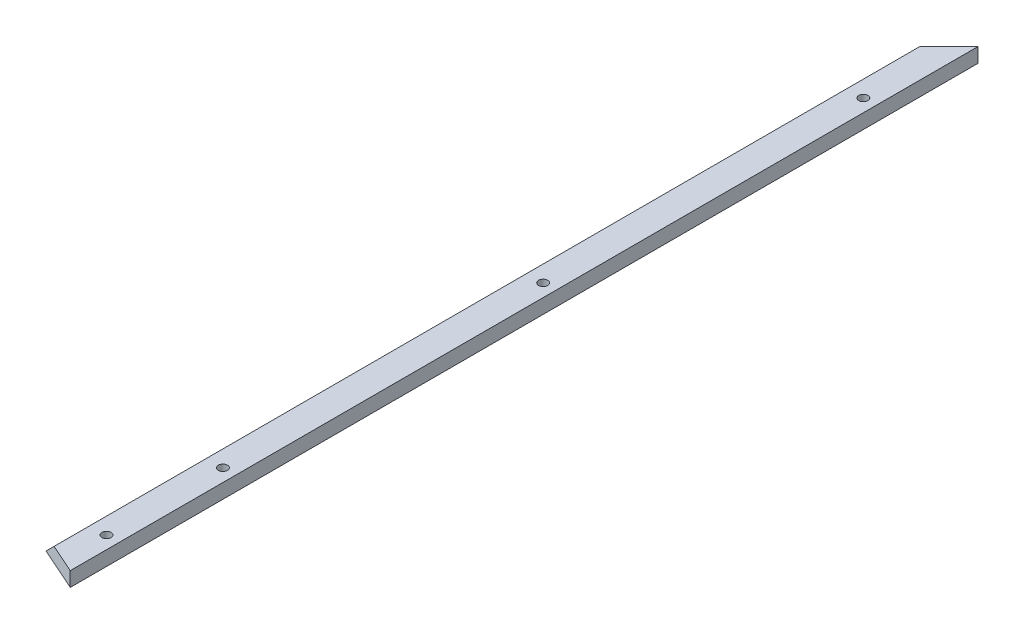
ISO-10303-21;
HEADER;
FILE_DESCRIPTION(('STEP AP214'),'2;1');
FILE_NAME('part.step','',(''),(''),'','','');
FILE_SCHEMA(('AUTOMOTIVE_DESIGN { 1 0 10303 214 1 1 1 1 }'));
ENDSEC;
DATA;
#1=APPLICATION_CONTEXT('core data for automotive mechanical design processes');
#2=APPLICATION_PROTOCOL_DEFINITION('international standard','automotive_design',2000,#1);
#3=PRODUCT_CONTEXT('',#1,'mechanical');
#4=PRODUCT('Part','Part','',(#3));
#5=PRODUCT_RELATED_PRODUCT_CATEGORY('part','',(#4));
#6=PRODUCT_DEFINITION_FORMATION('','',#4);
#7=PRODUCT_DEFINITION_CONTEXT('part definition',#1,'design');
#8=PRODUCT_DEFINITION('design','',#6,#7);
#9=PRODUCT_DEFINITION_SHAPE('','',#8);
#10=(LENGTH_UNIT() NAMED_UNIT(*) SI_UNIT(.MILLI.,.METRE.));
#11=(NAMED_UNIT(*) PLANE_ANGLE_UNIT() SI_UNIT($,.RADIAN.));
#12=(NAMED_UNIT(*) SI_UNIT($,.STERADIAN.) SOLID_ANGLE_UNIT());
#13=UNCERTAINTY_MEASURE_WITH_UNIT(LENGTH_MEASURE(1.E-05),#10,'distance_accuracy_value','');
#14=(GEOMETRIC_REPRESENTATION_CONTEXT(3) GLOBAL_UNCERTAINTY_ASSIGNED_CONTEXT((#13)) GLOBAL_UNIT_ASSIGNED_CONTEXT((#10,
#11,#12)) REPRESENTATION_CONTEXT('',''));
#15=CARTESIAN_POINT('',(0.,0.,0.));
#16=DIRECTION('',(0.,0.,1.));
#17=DIRECTION('',(1.,0.,0.));
#18=AXIS2_PLACEMENT_3D('',#15,#16,#17);
#19=CARTESIAN_POINT('',(-38.1,0.,1219.2));
#20=DIRECTION('',(0.,1.,0.));
#21=DIRECTION('',(0.,0.,1.));
#22=AXIS2_PLACEMENT_3D('',#19,#20,#21);
#23=PLANE('',#22);
#24=CARTESIAN_POINT('',(-11.1125,0.,711.2));
#25=DIRECTION('',(0.,1.,0.));
#26=DIRECTION('',(0.,0.,1.));
#27=AXIS2_PLACEMENT_3D('',#24,#25,#26);
#28=CIRCLE('',#27,3.96874999999999);
#29=CARTESIAN_POINT('',(-11.1125,0.,715.16875));
#30=VERTEX_POINT('',#29);
#31=EDGE_CURVE('E120',#30,#30,#28,.T.);
#32=ORIENTED_EDGE('',*,*,#31,.T.);
#33=EDGE_LOOP('',(#32));
#34=FACE_BOUND('',#33,.T.);
#35=CARTESIAN_POINT('',(-11.1124999999941,0.,50.8000000000001));
#36=DIRECTION('',(0.,-1.,0.));
#37=DIRECTION('',(0.,0.,-1.));
#38=AXIS2_PLACEMENT_3D('',#35,#36,#37);
#39=CIRCLE('',#38,3.96875);
#40=CARTESIAN_POINT('',(-11.1124999999941,0.,46.8312500000001));
#41=VERTEX_POINT('',#40);
#42=EDGE_CURVE('E110',#41,#41,#39,.T.);
#43=ORIENTED_EDGE('',*,*,#42,.F.);
#44=EDGE_LOOP('',(#43));
#45=FACE_BOUND('',#44,.T.);
#46=CARTESIAN_POINT('',(-11.1124999999971,0.,330.2));
#47=DIRECTION('',(0.,-1.,0.));
#48=DIRECTION('',(0.,0.,-1.));
#49=AXIS2_PLACEMENT_3D('',#46,#47,#48);
#50=CIRCLE('',#49,3.96875);
#51=CARTESIAN_POINT('',(-11.1124999999971,0.,326.23125));
#52=VERTEX_POINT('',#51);
#53=EDGE_CURVE('E104',#52,#52,#50,.T.);
#54=ORIENTED_EDGE('',*,*,#53,.F.);
#55=EDGE_LOOP('',(#54));
#56=FACE_BOUND('',#55,.T.);
#57=CARTESIAN_POINT('',(-11.1125,0.,609.6));
#58=DIRECTION('',(0.,-1.,0.));
#59=DIRECTION('',(0.,0.,-1.));
#60=AXIS2_PLACEMENT_3D('',#57,#58,#59);
#61=CIRCLE('',#60,3.96875);
#62=CARTESIAN_POINT('',(-11.1125,0.,605.63125));
#63=VERTEX_POINT('',#62);
#64=EDGE_CURVE('E98',#63,#63,#61,.T.);
#65=ORIENTED_EDGE('',*,*,#64,.F.);
#66=EDGE_LOOP('',(#65));
#67=FACE_BOUND('',#66,.T.);
#68=DIRECTION('',(0.,0.,-1.));
#69=VECTOR('',#68,1.);
#70=CARTESIAN_POINT('',(0.,0.,1219.2));
#71=LINE('',#70,#69);
#72=CARTESIAN_POINT('',(0.,0.,753.960087910256));
#73=VERTEX_POINT('',#72);
#74=CARTESIAN_POINT('',(0.,0.,-38.0999999999996));
#75=VERTEX_POINT('',#74);
#76=EDGE_CURVE('E39',#73,#75,#71,.T.);
#77=ORIENTED_EDGE('',*,*,#76,.F.);
#78=DIRECTION('',(0.913545457642599,0.,0.406736643075805));
#79=VECTOR('',#78,1.);
#80=CARTESIAN_POINT('',(-38.1000000000001,0.,736.996875));
#81=LINE('',#80,#79);
#82=CARTESIAN_POINT('',(-38.1000000000001,0.,736.996875));
#83=VERTEX_POINT('',#82);
#84=EDGE_CURVE('E73',#83,#73,#81,.T.);
#85=ORIENTED_EDGE('',*,*,#84,.F.);
#86=DIRECTION('',(0.,0.,-1.));
#87=VECTOR('',#86,1.);
#88=CARTESIAN_POINT('',(-38.1,0.,1219.2));
#89=LINE('',#88,#87);
#90=CARTESIAN_POINT('',(-38.1,0.,0.));
#91=VERTEX_POINT('',#90);
#92=EDGE_CURVE('E53',#83,#91,#89,.T.);
#93=ORIENTED_EDGE('',*,*,#92,.T.);
#94=DIRECTION('',(0.707106781186551,0.,-0.707106781186544));
#95=VECTOR('',#94,1.);
#96=CARTESIAN_POINT('',(14.7142632281583,0.,-52.8142632281578));
#97=LINE('',#96,#95);
#98=EDGE_CURVE('E114',#91,#75,#97,.T.);
#99=ORIENTED_EDGE('',*,*,#98,.T.);
#100=EDGE_LOOP('',(#77,#85,#93,#99));
#101=FACE_BOUND('',#100,.T.);
#102=ADVANCED_FACE('F32',(#34,#45,#56,#67,#101),#23,.F.);
#103=CARTESIAN_POINT('',(0.,0.,1219.2));
#104=DIRECTION('',(-1.,0.,0.));
#105=DIRECTION('',(0.,0.,1.));
#106=AXIS2_PLACEMENT_3D('',#103,#104,#105);
#107=PLANE('',#106);
#108=DIRECTION('',(0.,0.,-1.));
#109=VECTOR('',#108,1.);
#110=CARTESIAN_POINT('',(0.,12.7,1219.2));
#111=LINE('',#110,#109);
#112=CARTESIAN_POINT('',(0.,12.7,753.960087910256));
#113=VERTEX_POINT('',#112);
#114=CARTESIAN_POINT('',(0.,12.7,-38.0999999999996));
#115=VERTEX_POINT('',#114);
#116=EDGE_CURVE('E83',#113,#115,#111,.T.);
#117=ORIENTED_EDGE('',*,*,#116,.F.);
#118=DIRECTION('',(0.,-1.,0.));
#119=VECTOR('',#118,1.);
#120=CARTESIAN_POINT('',(0.,12.7,753.960087910256));
#121=LINE('',#120,#119);
#122=EDGE_CURVE('E71',#113,#73,#121,.T.);
#123=ORIENTED_EDGE('',*,*,#122,.T.);
#124=ORIENTED_EDGE('',*,*,#76,.T.);
#125=DIRECTION('',(0.,1.,0.));
#126=VECTOR('',#125,1.);
#127=CARTESIAN_POINT('',(0.,12.7,-38.0999999999996));
#128=LINE('',#127,#126);
#129=EDGE_CURVE('E90',#75,#115,#128,.T.);
#130=ORIENTED_EDGE('',*,*,#129,.T.);
#131=EDGE_LOOP('',(#117,#123,#124,#130));
#132=FACE_BOUND('',#131,.T.);
#133=ADVANCED_FACE('F88',(#132),#107,.F.);
#134=CARTESIAN_POINT('',(0.,12.7,1219.2));
#135=DIRECTION('',(0.,-1.,0.));
#136=DIRECTION('',(1.,0.,0.));
#137=AXIS2_PLACEMENT_3D('',#134,#135,#136);
#138=PLANE('',#137);
#139=CARTESIAN_POINT('',(-11.1125,12.7,711.2));
#140=DIRECTION('',(0.,1.,0.));
#141=DIRECTION('',(0.,0.,1.));
#142=AXIS2_PLACEMENT_3D('',#139,#140,#141);
#143=CIRCLE('',#142,3.96874999999999);
#144=CARTESIAN_POINT('',(-11.1125,12.7,715.16875));
#145=VERTEX_POINT('',#144);
#146=EDGE_CURVE('E124',#145,#145,#143,.T.);
#147=ORIENTED_EDGE('',*,*,#146,.F.);
#148=EDGE_LOOP('',(#147));
#149=FACE_BOUND('',#148,.T.);
#150=CARTESIAN_POINT('',(-11.1124999999941,12.7,50.8000000000001));
#151=DIRECTION('',(0.,-1.,0.));
#152=DIRECTION('',(0.,0.,-1.));
#153=AXIS2_PLACEMENT_3D('',#150,#151,#152);
#154=CIRCLE('',#153,3.96875);
#155=CARTESIAN_POINT('',(-11.1124999999941,12.7,46.8312500000001));
#156=VERTEX_POINT('',#155);
#157=EDGE_CURVE('E107',#156,#156,#154,.T.);
#158=ORIENTED_EDGE('',*,*,#157,.T.);
#159=EDGE_LOOP('',(#158));
#160=FACE_BOUND('',#159,.T.);
#161=CARTESIAN_POINT('',(-11.1124999999971,12.7,330.2));
#162=DIRECTION('',(0.,-1.,0.));
#163=DIRECTION('',(0.,0.,-1.));
#164=AXIS2_PLACEMENT_3D('',#161,#162,#163);
#165=CIRCLE('',#164,3.96875);
#166=CARTESIAN_POINT('',(-11.1124999999971,12.7,326.23125));
#167=VERTEX_POINT('',#166);
#168=EDGE_CURVE('E101',#167,#167,#165,.T.);
#169=ORIENTED_EDGE('',*,*,#168,.T.);
#170=EDGE_LOOP('',(#169));
#171=FACE_BOUND('',#170,.T.);
#172=CARTESIAN_POINT('',(-11.1125,12.7,609.6));
#173=DIRECTION('',(0.,-1.,0.));
#174=DIRECTION('',(0.,0.,-1.));
#175=AXIS2_PLACEMENT_3D('',#172,#173,#174);
#176=CIRCLE('',#175,3.96875);
#177=CARTESIAN_POINT('',(-11.1125,12.7,605.63125));
#178=VERTEX_POINT('',#177);
#179=EDGE_CURVE('E95',#178,#178,#176,.T.);
#180=ORIENTED_EDGE('',*,*,#179,.T.);
#181=EDGE_LOOP('',(#180));
#182=FACE_BOUND('',#181,.T.);
#183=DIRECTION('',(0.,0.,-1.));
#184=VECTOR('',#183,1.);
#185=CARTESIAN_POINT('',(-25.3999999999999,12.7,1219.2));
#186=LINE('',#185,#184);
#187=CARTESIAN_POINT('',(-25.3999999999999,12.7,742.651279303419));
#188=VERTEX_POINT('',#187);
#189=CARTESIAN_POINT('',(-25.3999999999999,12.7,-12.7));
#190=VERTEX_POINT('',#189);
#191=EDGE_CURVE('E85',#188,#190,#186,.T.);
#192=ORIENTED_EDGE('',*,*,#191,.F.);
#193=DIRECTION('',(0.913545457642599,0.,0.406736643075805));
#194=VECTOR('',#193,1.);
#195=CARTESIAN_POINT('',(-38.1000000000001,12.7,736.996875));
#196=LINE('',#195,#194);
#197=EDGE_CURVE('E46',#188,#113,#196,.T.);
#198=ORIENTED_EDGE('',*,*,#197,.T.);
#199=ORIENTED_EDGE('',*,*,#116,.T.);
#200=DIRECTION('',(-0.707106781186551,0.,0.707106781186544));
#201=VECTOR('',#200,1.);
#202=CARTESIAN_POINT('',(2.01426322815824,12.7,-40.1142632281579));
#203=LINE('',#202,#201);
#204=EDGE_CURVE('E77',#115,#190,#203,.T.);
#205=ORIENTED_EDGE('',*,*,#204,.T.);
#206=EDGE_LOOP('',(#192,#198,#199,#205));
#207=FACE_BOUND('',#206,.T.);
#208=ADVANCED_FACE('F81',(#149,#160,#171,#182,#207),#138,.F.);
#209=CARTESIAN_POINT('',(-25.3999999999999,12.7,1219.2));
#210=DIRECTION('',(0.707106781186544,-0.707106781186551,0.));
#211=DIRECTION('',(0.707106781186551,0.707106781186544,0.));
#212=AXIS2_PLACEMENT_3D('',#209,#210,#211);
#213=PLANE('',#212);
#214=ORIENTED_EDGE('',*,*,#92,.F.);
#215=DIRECTION('',(0.67447145594718,0.674471455947173,0.300294039609501));
#216=VECTOR('',#215,1.);
#217=CARTESIAN_POINT('',(71.1200626164102,109.220062616409,785.624779888021));
#218=LINE('',#217,#216);
#219=EDGE_CURVE('E11',#83,#188,#218,.T.);
#220=ORIENTED_EDGE('',*,*,#219,.T.);
#221=ORIENTED_EDGE('',*,*,#191,.T.);
#222=DIRECTION('',(-0.57735026918963,-0.577350269189623,0.577350269189624));
#223=VECTOR('',#222,1.);
#224=CARTESIAN_POINT('',(-15.5904911812278,22.5095088187719,-22.5095088187719));
#225=LINE('',#224,#223);
#226=EDGE_CURVE('E116',#190,#91,#225,.T.);
#227=ORIENTED_EDGE('',*,*,#226,.T.);
#228=EDGE_LOOP('',(#214,#220,#221,#227));
#229=FACE_BOUND('',#228,.T.);
#230=ADVANCED_FACE('F132',(#229),#213,.F.);
#231=CARTESIAN_POINT('',(-11.1125,0.,609.6));
#232=DIRECTION('',(0.,-1.,0.));
#233=DIRECTION('',(0.,0.,-1.));
#234=AXIS2_PLACEMENT_3D('',#231,#232,#233);
#235=CYLINDRICAL_SURFACE('',#234,3.96875);
#236=ORIENTED_EDGE('',*,*,#179,.F.);
#237=EDGE_LOOP('',(#236));
#238=FACE_BOUND('',#237,.T.);
#239=ORIENTED_EDGE('',*,*,#64,.T.);
#240=EDGE_LOOP('',(#239));
#241=FACE_BOUND('',#240,.T.);
#242=ADVANCED_FACE('F140',(#238,#241),#235,.F.);
#243=CARTESIAN_POINT('',(-11.1124999999971,0.,330.2));
#244=DIRECTION('',(0.,-1.,0.));
#245=DIRECTION('',(0.,0.,-1.));
#246=AXIS2_PLACEMENT_3D('',#243,#244,#245);
#247=CYLINDRICAL_SURFACE('',#246,3.96875);
#248=ORIENTED_EDGE('',*,*,#168,.F.);
#249=EDGE_LOOP('',(#248));
#250=FACE_BOUND('',#249,.T.);
#251=ORIENTED_EDGE('',*,*,#53,.T.);
#252=EDGE_LOOP('',(#251));
#253=FACE_BOUND('',#252,.T.);
#254=ADVANCED_FACE('F143',(#250,#253),#247,.F.);
#255=CARTESIAN_POINT('',(-11.1124999999941,0.,50.8000000000001));
#256=DIRECTION('',(0.,-1.,0.));
#257=DIRECTION('',(0.,0.,-1.));
#258=AXIS2_PLACEMENT_3D('',#255,#256,#257);
#259=CYLINDRICAL_SURFACE('',#258,3.96875);
#260=ORIENTED_EDGE('',*,*,#157,.F.);
#261=EDGE_LOOP('',(#260));
#262=FACE_BOUND('',#261,.T.);
#263=ORIENTED_EDGE('',*,*,#42,.T.);
#264=EDGE_LOOP('',(#263));
#265=FACE_BOUND('',#264,.T.);
#266=ADVANCED_FACE('F194',(#262,#265),#259,.F.);
#267=CARTESIAN_POINT('',(-19.0499999999998,0.,-19.05));
#268=DIRECTION('',(0.707106781186544,0.,0.707106781186551));
#269=DIRECTION('',(0.707106781186551,0.,-0.707106781186544));
#270=AXIS2_PLACEMENT_3D('',#267,#268,#269);
#271=PLANE('',#270);
#272=ORIENTED_EDGE('',*,*,#98,.F.);
#273=ORIENTED_EDGE('',*,*,#226,.F.);
#274=ORIENTED_EDGE('',*,*,#204,.F.);
#275=ORIENTED_EDGE('',*,*,#129,.F.);
#276=EDGE_LOOP('',(#272,#273,#274,#275));
#277=FACE_BOUND('',#276,.T.);
#278=ADVANCED_FACE('F150',(#277),#271,.F.);
#279=CARTESIAN_POINT('',(-38.1000000000001,12.7,736.996875));
#280=DIRECTION('',(0.406736643075805,0.,-0.913545457642599));
#281=DIRECTION('',(-0.913545457642599,0.,-0.406736643075805));
#282=AXIS2_PLACEMENT_3D('',#279,#280,#281);
#283=PLANE('',#282);
#284=ORIENTED_EDGE('',*,*,#84,.T.);
#285=ORIENTED_EDGE('',*,*,#122,.F.);
#286=ORIENTED_EDGE('',*,*,#197,.F.);
#287=ORIENTED_EDGE('',*,*,#219,.F.);
#288=EDGE_LOOP('',(#284,#285,#286,#287));
#289=FACE_BOUND('',#288,.T.);
#290=ADVANCED_FACE('F72',(#289),#283,.F.);
#291=CARTESIAN_POINT('',(-11.1125,12.7,711.2));
#292=DIRECTION('',(0.,1.,0.));
#293=DIRECTION('',(0.,0.,1.));
#294=AXIS2_PLACEMENT_3D('',#291,#292,#293);
#295=CYLINDRICAL_SURFACE('',#294,3.96874999999999);
#296=ORIENTED_EDGE('',*,*,#31,.F.);
#297=EDGE_LOOP('',(#296));
#298=FACE_BOUND('',#297,.T.);
#299=ORIENTED_EDGE('',*,*,#146,.T.);
#300=EDGE_LOOP('',(#299));
#301=FACE_BOUND('',#300,.T.);
#302=ADVANCED_FACE('F128',(#298,#301),#295,.F.);
#303=CLOSED_SHELL('',(#102,#133,#208,#230,#242,#254,#266,#278,#290,#302));
#304=MANIFOLD_SOLID_BREP('B2',#303);
#305=ADVANCED_BREP_SHAPE_REPRESENTATION('',(#18,#304),#14);
#306=SHAPE_DEFINITION_REPRESENTATION(#9,#305);
ENDSEC;
END-ISO-10303-21;
